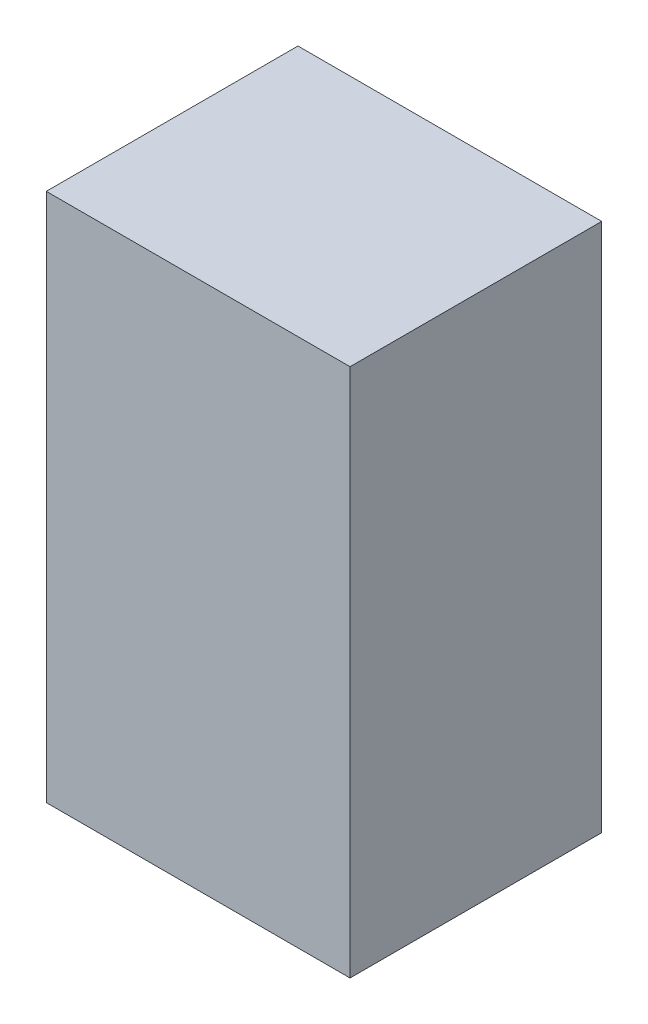
ISO-10303-21;
HEADER;
FILE_DESCRIPTION(('STEP AP214'),'2;1');
FILE_NAME('part.step','',(''),(''),'','','');
FILE_SCHEMA(('AUTOMOTIVE_DESIGN { 1 0 10303 214 1 1 1 1 }'));
ENDSEC;
DATA;
#1=APPLICATION_CONTEXT('core data for automotive mechanical design processes');
#2=APPLICATION_PROTOCOL_DEFINITION('international standard','automotive_design',2000,#1);
#3=PRODUCT_CONTEXT('',#1,'mechanical');
#4=PRODUCT('Part','Part','',(#3));
#5=PRODUCT_RELATED_PRODUCT_CATEGORY('part','',(#4));
#6=PRODUCT_DEFINITION_FORMATION('','',#4);
#7=PRODUCT_DEFINITION_CONTEXT('part definition',#1,'design');
#8=PRODUCT_DEFINITION('design','',#6,#7);
#9=PRODUCT_DEFINITION_SHAPE('','',#8);
#10=(LENGTH_UNIT() NAMED_UNIT(*) SI_UNIT(.MILLI.,.METRE.));
#11=(NAMED_UNIT(*) PLANE_ANGLE_UNIT() SI_UNIT($,.RADIAN.));
#12=(NAMED_UNIT(*) SI_UNIT($,.STERADIAN.) SOLID_ANGLE_UNIT());
#13=UNCERTAINTY_MEASURE_WITH_UNIT(LENGTH_MEASURE(1.E-05),#10,'distance_accuracy_value','');
#14=(GEOMETRIC_REPRESENTATION_CONTEXT(3) GLOBAL_UNCERTAINTY_ASSIGNED_CONTEXT((#13)) GLOBAL_UNIT_ASSIGNED_CONTEXT((#10,
#11,#12)) REPRESENTATION_CONTEXT('',''));
#15=CARTESIAN_POINT('',(0.,0.,0.));
#16=DIRECTION('',(0.,0.,1.));
#17=DIRECTION('',(1.,0.,0.));
#18=AXIS2_PLACEMENT_3D('',#15,#16,#17);
#19=CARTESIAN_POINT('',(-0.87499952,-1.52499822,1.44999964));
#20=DIRECTION('',(0.,0.,1.));
#21=DIRECTION('',(1.,0.,0.));
#22=AXIS2_PLACEMENT_3D('',#19,#20,#21);
#23=PLANE('',#22);
#24=DIRECTION('',(1.,0.,0.));
#25=VECTOR('',#24,1.);
#26=CARTESIAN_POINT('',(-0.87499952,1.52500076,1.44999964));
#27=LINE('',#26,#25);
#28=CARTESIAN_POINT('',(-0.87499952,1.52500076,1.44999964));
#29=VERTEX_POINT('',#28);
#30=CARTESIAN_POINT('',(0.87499952,1.52500076,1.44999964));
#31=VERTEX_POINT('',#30);
#32=EDGE_CURVE('E53',#29,#31,#27,.T.);
#33=ORIENTED_EDGE('',*,*,#32,.F.);
#34=DIRECTION('',(0.,1.,0.));
#35=VECTOR('',#34,1.);
#36=CARTESIAN_POINT('',(-0.87499952,-1.52499822,1.44999964));
#37=LINE('',#36,#35);
#38=CARTESIAN_POINT('',(-0.87499952,-1.52499822,1.44999964));
#39=VERTEX_POINT('',#38);
#40=EDGE_CURVE('E68',#39,#29,#37,.T.);
#41=ORIENTED_EDGE('',*,*,#40,.F.);
#42=DIRECTION('',(1.,0.,0.));
#43=VECTOR('',#42,1.);
#44=CARTESIAN_POINT('',(0.87499952,-1.52499822,1.44999964));
#45=LINE('',#44,#43);
#46=CARTESIAN_POINT('',(0.87499952,-1.52499822,1.44999964));
#47=VERTEX_POINT('',#46);
#48=EDGE_CURVE('E20',#47,#39,#45,.F.);
#49=ORIENTED_EDGE('',*,*,#48,.F.);
#50=DIRECTION('',(0.,1.,0.));
#51=VECTOR('',#50,1.);
#52=CARTESIAN_POINT('',(0.87499952,1.52500076,1.44999964));
#53=LINE('',#52,#51);
#54=EDGE_CURVE('E58',#31,#47,#53,.F.);
#55=ORIENTED_EDGE('',*,*,#54,.F.);
#56=EDGE_LOOP('',(#33,#41,#49,#55));
#57=FACE_BOUND('',#56,.T.);
#58=ADVANCED_FACE('F17',(#57),#23,.T.);
#59=CARTESIAN_POINT('',(0.87499952,-1.52499822,0.));
#60=DIRECTION('',(0.,-1.,0.));
#61=DIRECTION('',(0.,0.,-1.));
#62=AXIS2_PLACEMENT_3D('',#59,#60,#61);
#63=PLANE('',#62);
#64=DIRECTION('',(0.,0.,1.));
#65=VECTOR('',#64,1.);
#66=CARTESIAN_POINT('',(-0.87499952,-1.52499822,0.));
#67=LINE('',#66,#65);
#68=CARTESIAN_POINT('',(-0.87499952,-1.52499822,0.));
#69=VERTEX_POINT('',#68);
#70=EDGE_CURVE('E79',#69,#39,#67,.T.);
#71=ORIENTED_EDGE('',*,*,#70,.F.);
#72=DIRECTION('',(1.,0.,0.));
#73=VECTOR('',#72,1.);
#74=CARTESIAN_POINT('',(-0.87499952,-1.52499822,0.));
#75=LINE('',#74,#73);
#76=CARTESIAN_POINT('',(0.87499952,-1.52499822,0.));
#77=VERTEX_POINT('',#76);
#78=EDGE_CURVE('E74',#69,#77,#75,.T.);
#79=ORIENTED_EDGE('',*,*,#78,.T.);
#80=DIRECTION('',(0.,0.,-1.));
#81=VECTOR('',#80,1.);
#82=CARTESIAN_POINT('',(0.87499952,-1.52499822,0.));
#83=LINE('',#82,#81);
#84=EDGE_CURVE('E63',#47,#77,#83,.T.);
#85=ORIENTED_EDGE('',*,*,#84,.F.);
#86=ORIENTED_EDGE('',*,*,#48,.T.);
#87=EDGE_LOOP('',(#71,#79,#85,#86));
#88=FACE_BOUND('',#87,.T.);
#89=ADVANCED_FACE('F73',(#88),#63,.T.);
#90=CARTESIAN_POINT('',(0.87499952,1.52500076,0.));
#91=DIRECTION('',(1.,0.,0.));
#92=DIRECTION('',(0.,0.,-1.));
#93=AXIS2_PLACEMENT_3D('',#90,#91,#92);
#94=PLANE('',#93);
#95=ORIENTED_EDGE('',*,*,#84,.T.);
#96=DIRECTION('',(0.,1.,0.));
#97=VECTOR('',#96,1.);
#98=CARTESIAN_POINT('',(0.87499952,-1.52499822,0.));
#99=LINE('',#98,#97);
#100=CARTESIAN_POINT('',(0.87499952,1.52500076,0.));
#101=VERTEX_POINT('',#100);
#102=EDGE_CURVE('E84',#77,#101,#99,.T.);
#103=ORIENTED_EDGE('',*,*,#102,.T.);
#104=DIRECTION('',(0.,0.,1.));
#105=VECTOR('',#104,1.);
#106=CARTESIAN_POINT('',(0.87499952,1.52500076,0.));
#107=LINE('',#106,#105);
#108=EDGE_CURVE('E65',#31,#101,#107,.F.);
#109=ORIENTED_EDGE('',*,*,#108,.F.);
#110=ORIENTED_EDGE('',*,*,#54,.T.);
#111=EDGE_LOOP('',(#95,#103,#109,#110));
#112=FACE_BOUND('',#111,.T.);
#113=ADVANCED_FACE('F60',(#112),#94,.T.);
#114=CARTESIAN_POINT('',(-0.87499952,1.52500076,0.));
#115=DIRECTION('',(0.,1.,0.));
#116=DIRECTION('',(0.,0.,1.));
#117=AXIS2_PLACEMENT_3D('',#114,#115,#116);
#118=PLANE('',#117);
#119=ORIENTED_EDGE('',*,*,#108,.T.);
#120=DIRECTION('',(1.,0.,0.));
#121=VECTOR('',#120,1.);
#122=CARTESIAN_POINT('',(-0.87499952,1.52500076,0.));
#123=LINE('',#122,#121);
#124=CARTESIAN_POINT('',(-0.87499952,1.52500076,0.));
#125=VERTEX_POINT('',#124);
#126=EDGE_CURVE('E26',#101,#125,#123,.F.);
#127=ORIENTED_EDGE('',*,*,#126,.T.);
#128=DIRECTION('',(0.,0.,1.));
#129=VECTOR('',#128,1.);
#130=CARTESIAN_POINT('',(-0.87499952,1.52500076,0.));
#131=LINE('',#130,#129);
#132=EDGE_CURVE('E34',#29,#125,#131,.F.);
#133=ORIENTED_EDGE('',*,*,#132,.F.);
#134=ORIENTED_EDGE('',*,*,#32,.T.);
#135=EDGE_LOOP('',(#119,#127,#133,#134));
#136=FACE_BOUND('',#135,.T.);
#137=ADVANCED_FACE('F88',(#136),#118,.T.);
#138=CARTESIAN_POINT('',(-0.87499952,-1.52499822,0.));
#139=DIRECTION('',(-1.,0.,0.));
#140=DIRECTION('',(0.,0.,1.));
#141=AXIS2_PLACEMENT_3D('',#138,#139,#140);
#142=PLANE('',#141);
#143=ORIENTED_EDGE('',*,*,#132,.T.);
#144=DIRECTION('',(0.,1.,0.));
#145=VECTOR('',#144,1.);
#146=CARTESIAN_POINT('',(-0.87499952,-1.52499822,0.));
#147=LINE('',#146,#145);
#148=EDGE_CURVE('E11',#125,#69,#147,.F.);
#149=ORIENTED_EDGE('',*,*,#148,.T.);
#150=ORIENTED_EDGE('',*,*,#70,.T.);
#151=ORIENTED_EDGE('',*,*,#40,.T.);
#152=EDGE_LOOP('',(#143,#149,#150,#151));
#153=FACE_BOUND('',#152,.T.);
#154=ADVANCED_FACE('F91',(#153),#142,.T.);
#155=CARTESIAN_POINT('',(-0.87499952,-1.52499822,0.));
#156=DIRECTION('',(0.,0.,1.));
#157=DIRECTION('',(1.,0.,0.));
#158=AXIS2_PLACEMENT_3D('',#155,#156,#157);
#159=PLANE('',#158);
#160=ORIENTED_EDGE('',*,*,#126,.F.);
#161=ORIENTED_EDGE('',*,*,#102,.F.);
#162=ORIENTED_EDGE('',*,*,#78,.F.);
#163=ORIENTED_EDGE('',*,*,#148,.F.);
#164=EDGE_LOOP('',(#160,#161,#162,#163));
#165=FACE_BOUND('',#164,.T.);
#166=ADVANCED_FACE('F90',(#165),#159,.F.);
#167=CLOSED_SHELL('',(#58,#89,#113,#137,#154,#166));
#168=MANIFOLD_SOLID_BREP('B1',#167);
#169=ADVANCED_BREP_SHAPE_REPRESENTATION('',(#18,#168),#14);
#170=SHAPE_DEFINITION_REPRESENTATION(#9,#169);
ENDSEC;
END-ISO-10303-21;
